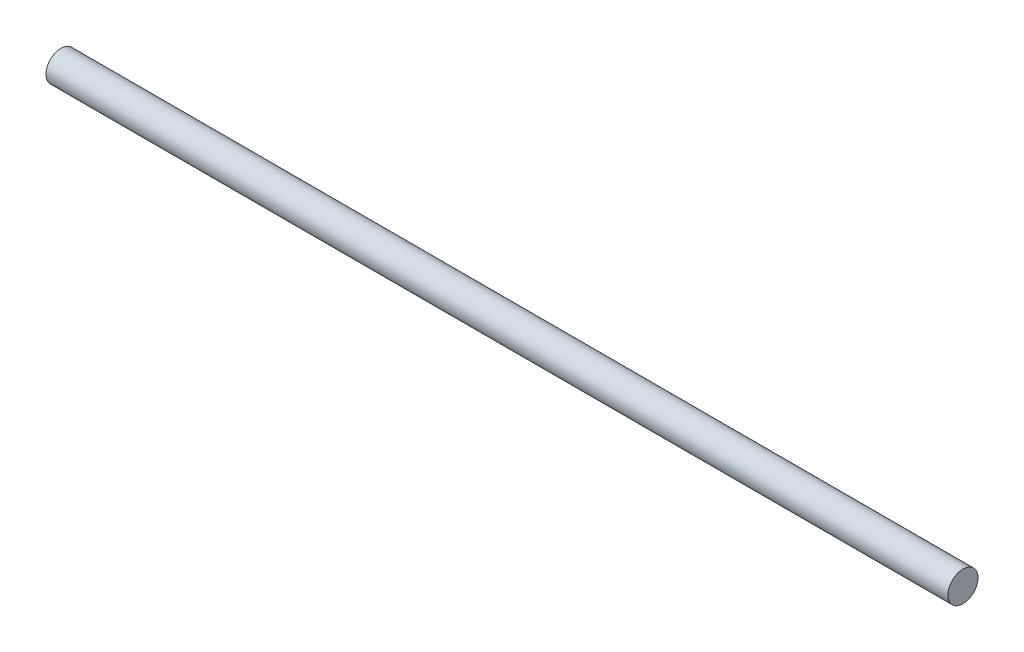
ISO-10303-21;
HEADER;
FILE_DESCRIPTION(('STEP AP214'),'2;1');
FILE_NAME('part.step','',(''),(''),'','','');
FILE_SCHEMA(('AUTOMOTIVE_DESIGN { 1 0 10303 214 1 1 1 1 }'));
ENDSEC;
DATA;
#1=APPLICATION_CONTEXT('core data for automotive mechanical design processes');
#2=APPLICATION_PROTOCOL_DEFINITION('international standard','automotive_design',2000,#1);
#3=PRODUCT_CONTEXT('',#1,'mechanical');
#4=PRODUCT('Part','Part','',(#3));
#5=PRODUCT_RELATED_PRODUCT_CATEGORY('part','',(#4));
#6=PRODUCT_DEFINITION_FORMATION('','',#4);
#7=PRODUCT_DEFINITION_CONTEXT('part definition',#1,'design');
#8=PRODUCT_DEFINITION('design','',#6,#7);
#9=PRODUCT_DEFINITION_SHAPE('','',#8);
#10=(LENGTH_UNIT() NAMED_UNIT(*) SI_UNIT(.MILLI.,.METRE.));
#11=(NAMED_UNIT(*) PLANE_ANGLE_UNIT() SI_UNIT($,.RADIAN.));
#12=(NAMED_UNIT(*) SI_UNIT($,.STERADIAN.) SOLID_ANGLE_UNIT());
#13=UNCERTAINTY_MEASURE_WITH_UNIT(LENGTH_MEASURE(1.E-05),#10,'distance_accuracy_value','');
#14=(GEOMETRIC_REPRESENTATION_CONTEXT(3) GLOBAL_UNCERTAINTY_ASSIGNED_CONTEXT((#13)) GLOBAL_UNIT_ASSIGNED_CONTEXT((#10,
#11,#12)) REPRESENTATION_CONTEXT('',''));
#15=CARTESIAN_POINT('',(0.,0.,0.));
#16=DIRECTION('',(0.,0.,1.));
#17=DIRECTION('',(1.,0.,0.));
#18=AXIS2_PLACEMENT_3D('',#15,#16,#17);
#19=CARTESIAN_POINT('',(-30.,0.,0.));
#20=DIRECTION('',(1.,0.,0.));
#21=DIRECTION('',(0.,0.,-1.));
#22=AXIS2_PLACEMENT_3D('',#19,#20,#21);
#23=CYLINDRICAL_SURFACE('',#22,1.);
#24=CARTESIAN_POINT('',(-30.,0.,0.));
#25=DIRECTION('',(1.,0.,0.));
#26=DIRECTION('',(0.,0.,-1.));
#27=AXIS2_PLACEMENT_3D('',#24,#25,#26);
#28=CIRCLE('',#27,1.);
#29=CARTESIAN_POINT('',(-30.,0.,-1.));
#30=VERTEX_POINT('',#29);
#31=EDGE_CURVE('E10',#30,#30,#28,.T.);
#32=ORIENTED_EDGE('',*,*,#31,.T.);
#33=EDGE_LOOP('',(#32));
#34=FACE_BOUND('',#33,.T.);
#35=CARTESIAN_POINT('',(30.,0.,0.));
#36=DIRECTION('',(1.,0.,0.));
#37=DIRECTION('',(0.,0.,-1.));
#38=AXIS2_PLACEMENT_3D('',#35,#36,#37);
#39=CIRCLE('',#38,1.);
#40=CARTESIAN_POINT('',(30.,0.,-1.));
#41=VERTEX_POINT('',#40);
#42=EDGE_CURVE('E44',#41,#41,#39,.T.);
#43=ORIENTED_EDGE('',*,*,#42,.F.);
#44=EDGE_LOOP('',(#43));
#45=FACE_BOUND('',#44,.T.);
#46=ADVANCED_FACE('F37',(#34,#45),#23,.T.);
#47=CARTESIAN_POINT('',(-30.,0.,0.));
#48=DIRECTION('',(1.,0.,0.));
#49=DIRECTION('',(0.,0.,-1.));
#50=AXIS2_PLACEMENT_3D('',#47,#48,#49);
#51=PLANE('',#50);
#52=ORIENTED_EDGE('',*,*,#31,.F.);
#53=EDGE_LOOP('',(#52));
#54=FACE_BOUND('',#53,.T.);
#55=ADVANCED_FACE('F54',(#54),#51,.F.);
#56=CARTESIAN_POINT('',(30.,0.,0.));
#57=DIRECTION('',(1.,0.,0.));
#58=DIRECTION('',(0.,0.,-1.));
#59=AXIS2_PLACEMENT_3D('',#56,#57,#58);
#60=PLANE('',#59);
#61=ORIENTED_EDGE('',*,*,#42,.T.);
#62=EDGE_LOOP('',(#61));
#63=FACE_BOUND('',#62,.T.);
#64=ADVANCED_FACE('F51',(#63),#60,.T.);
#65=CLOSED_SHELL('',(#46,#55,#64));
#66=MANIFOLD_SOLID_BREP('B2',#65);
#67=ADVANCED_BREP_SHAPE_REPRESENTATION('',(#18,#66),#14);
#68=SHAPE_DEFINITION_REPRESENTATION(#9,#67);
ENDSEC;
END-ISO-10303-21;
